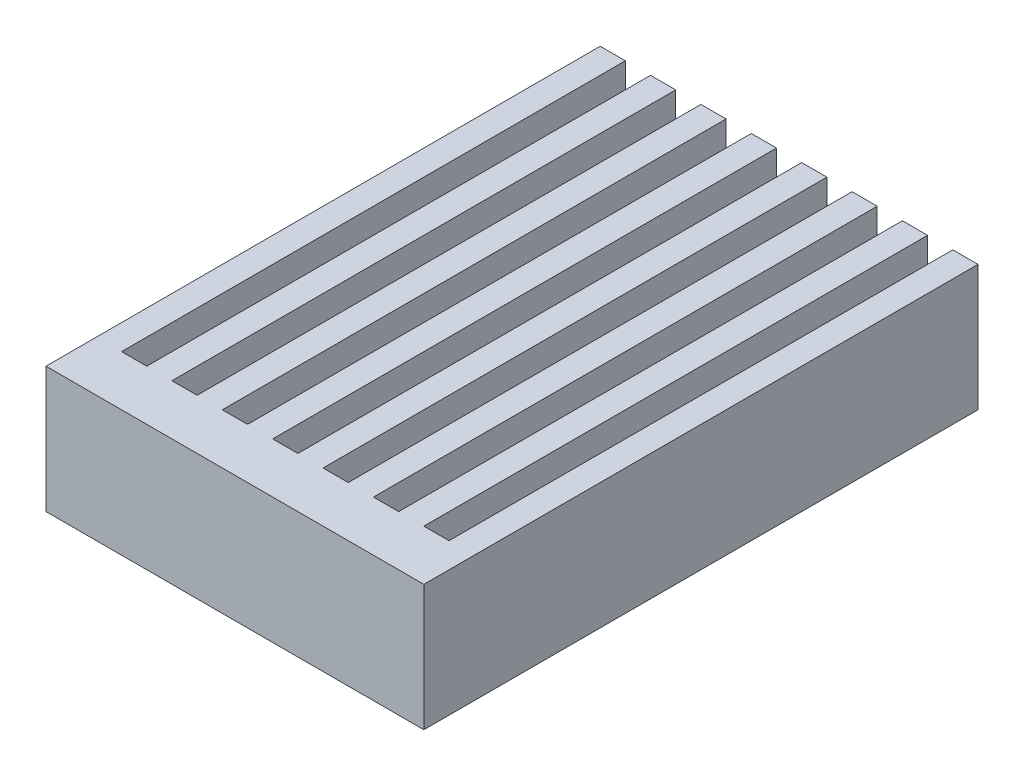
ISO-10303-21;
HEADER;
FILE_DESCRIPTION(('STEP AP214'),'2;1');
FILE_NAME('part.step','',(''),(''),'','','');
FILE_SCHEMA(('AUTOMOTIVE_DESIGN { 1 0 10303 214 1 1 1 1 }'));
ENDSEC;
DATA;
#1=APPLICATION_CONTEXT('core data for automotive mechanical design processes');
#2=APPLICATION_PROTOCOL_DEFINITION('international standard','automotive_design',2000,#1);
#3=PRODUCT_CONTEXT('',#1,'mechanical');
#4=PRODUCT('Part','Part','',(#3));
#5=PRODUCT_RELATED_PRODUCT_CATEGORY('part','',(#4));
#6=PRODUCT_DEFINITION_FORMATION('','',#4);
#7=PRODUCT_DEFINITION_CONTEXT('part definition',#1,'design');
#8=PRODUCT_DEFINITION('design','',#6,#7);
#9=PRODUCT_DEFINITION_SHAPE('','',#8);
#10=(LENGTH_UNIT() NAMED_UNIT(*) SI_UNIT(.MILLI.,.METRE.));
#11=(NAMED_UNIT(*) PLANE_ANGLE_UNIT() SI_UNIT($,.RADIAN.));
#12=(NAMED_UNIT(*) SI_UNIT($,.STERADIAN.) SOLID_ANGLE_UNIT());
#13=UNCERTAINTY_MEASURE_WITH_UNIT(LENGTH_MEASURE(1.E-05),#10,'distance_accuracy_value','');
#14=(GEOMETRIC_REPRESENTATION_CONTEXT(3) GLOBAL_UNCERTAINTY_ASSIGNED_CONTEXT((#13)) GLOBAL_UNIT_ASSIGNED_CONTEXT((#10,
#11,#12)) REPRESENTATION_CONTEXT('',''));
#15=CARTESIAN_POINT('',(0.,0.,0.));
#16=DIRECTION('',(0.,0.,1.));
#17=DIRECTION('',(1.,0.,0.));
#18=AXIS2_PLACEMENT_3D('',#15,#16,#17);
#19=CARTESIAN_POINT('',(-5.69333333333333,5.,0.313333333333333));
#20=DIRECTION('',(0.,0.,-1.));
#21=DIRECTION('',(-1.,0.,0.));
#22=AXIS2_PLACEMENT_3D('',#19,#20,#21);
#23=PLANE('',#22);
#24=DIRECTION('',(0.,-1.,0.));
#25=VECTOR('',#24,1.);
#26=CARTESIAN_POINT('',(8.30666666666667,5.,0.313333333333333));
#27=LINE('',#26,#25);
#28=CARTESIAN_POINT('',(8.30666666666667,5.,0.313333333333333));
#29=VERTEX_POINT('',#28);
#30=CARTESIAN_POINT('',(8.30666666666667,0.,0.313333333333333));
#31=VERTEX_POINT('',#30);
#32=EDGE_CURVE('E283',#29,#31,#27,.T.);
#33=ORIENTED_EDGE('',*,*,#32,.T.);
#34=DIRECTION('',(1.,0.,0.));
#35=VECTOR('',#34,1.);
#36=CARTESIAN_POINT('',(-5.69333333333333,0.,0.313333333333333));
#37=LINE('',#36,#35);
#38=CARTESIAN_POINT('',(7.30666666666667,0.,0.313333333333333));
#39=VERTEX_POINT('',#38);
#40=EDGE_CURVE('E473',#39,#31,#37,.T.);
#41=ORIENTED_EDGE('',*,*,#40,.F.);
#42=DIRECTION('',(0.,-1.,0.));
#43=VECTOR('',#42,1.);
#44=CARTESIAN_POINT('',(7.30666666666667,5.,0.313333333333332));
#45=LINE('',#44,#43);
#46=CARTESIAN_POINT('',(7.30666666666667,5.,0.313333333333332));
#47=VERTEX_POINT('',#46);
#48=EDGE_CURVE('E58',#47,#39,#45,.T.);
#49=ORIENTED_EDGE('',*,*,#48,.F.);
#50=DIRECTION('',(1.,0.,0.));
#51=VECTOR('',#50,1.);
#52=CARTESIAN_POINT('',(-5.69333333333333,5.,0.313333333333333));
#53=LINE('',#52,#51);
#54=EDGE_CURVE('E466',#47,#29,#53,.T.);
#55=ORIENTED_EDGE('',*,*,#54,.T.);
#56=EDGE_LOOP('',(#33,#41,#49,#55));
#57=FACE_BOUND('',#56,.T.);
#58=ADVANCED_FACE('F43',(#57),#23,.T.);
#59=DIRECTION('',(0.,-1.,0.));
#60=VECTOR('',#59,1.);
#61=CARTESIAN_POINT('',(6.30666666666667,5.,0.313333333333333));
#62=LINE('',#61,#60);
#63=CARTESIAN_POINT('',(6.30666666666667,5.,0.313333333333333));
#64=VERTEX_POINT('',#63);
#65=CARTESIAN_POINT('',(6.30666666666667,0.,0.313333333333333));
#66=VERTEX_POINT('',#65);
#67=EDGE_CURVE('E302',#64,#66,#62,.T.);
#68=ORIENTED_EDGE('',*,*,#67,.T.);
#69=CARTESIAN_POINT('',(5.30666666666667,0.,0.313333333333333));
#70=VERTEX_POINT('',#69);
#71=EDGE_CURVE('E536',#70,#66,#37,.T.);
#72=ORIENTED_EDGE('',*,*,#71,.F.);
#73=DIRECTION('',(0.,-1.,0.));
#74=VECTOR('',#73,1.);
#75=CARTESIAN_POINT('',(5.30666666666667,5.,0.313333333333332));
#76=LINE('',#75,#74);
#77=CARTESIAN_POINT('',(5.30666666666667,5.,0.313333333333332));
#78=VERTEX_POINT('',#77);
#79=EDGE_CURVE('E66',#78,#70,#76,.T.);
#80=ORIENTED_EDGE('',*,*,#79,.F.);
#81=EDGE_CURVE('E492',#78,#64,#53,.T.);
#82=ORIENTED_EDGE('',*,*,#81,.T.);
#83=EDGE_LOOP('',(#68,#72,#80,#82));
#84=FACE_BOUND('',#83,.T.);
#85=ADVANCED_FACE('F541',(#84),#23,.T.);
#86=DIRECTION('',(0.,-1.,0.));
#87=VECTOR('',#86,1.);
#88=CARTESIAN_POINT('',(4.30666666666667,5.,0.313333333333333));
#89=LINE('',#88,#87);
#90=CARTESIAN_POINT('',(4.30666666666667,5.,0.313333333333333));
#91=VERTEX_POINT('',#90);
#92=CARTESIAN_POINT('',(4.30666666666667,0.,0.313333333333333));
#93=VERTEX_POINT('',#92);
#94=EDGE_CURVE('E326',#91,#93,#89,.T.);
#95=ORIENTED_EDGE('',*,*,#94,.T.);
#96=CARTESIAN_POINT('',(3.30666666666667,0.,0.313333333333333));
#97=VERTEX_POINT('',#96);
#98=EDGE_CURVE('E532',#97,#93,#37,.T.);
#99=ORIENTED_EDGE('',*,*,#98,.F.);
#100=DIRECTION('',(0.,-1.,0.));
#101=VECTOR('',#100,1.);
#102=CARTESIAN_POINT('',(3.30666666666667,5.,0.313333333333332));
#103=LINE('',#102,#101);
#104=CARTESIAN_POINT('',(3.30666666666667,5.,0.313333333333332));
#105=VERTEX_POINT('',#104);
#106=EDGE_CURVE('E364',#105,#97,#103,.T.);
#107=ORIENTED_EDGE('',*,*,#106,.F.);
#108=EDGE_CURVE('E494',#105,#91,#53,.T.);
#109=ORIENTED_EDGE('',*,*,#108,.T.);
#110=EDGE_LOOP('',(#95,#99,#107,#109));
#111=FACE_BOUND('',#110,.T.);
#112=ADVANCED_FACE('F567',(#111),#23,.T.);
#113=DIRECTION('',(0.,-1.,0.));
#114=VECTOR('',#113,1.);
#115=CARTESIAN_POINT('',(2.30666666666667,5.,0.313333333333333));
#116=LINE('',#115,#114);
#117=CARTESIAN_POINT('',(2.30666666666667,5.,0.313333333333333));
#118=VERTEX_POINT('',#117);
#119=CARTESIAN_POINT('',(2.30666666666667,0.,0.313333333333333));
#120=VERTEX_POINT('',#119);
#121=EDGE_CURVE('E350',#118,#120,#116,.T.);
#122=ORIENTED_EDGE('',*,*,#121,.T.);
#123=CARTESIAN_POINT('',(1.30666666666667,0.,0.313333333333333));
#124=VERTEX_POINT('',#123);
#125=EDGE_CURVE('E529',#124,#120,#37,.T.);
#126=ORIENTED_EDGE('',*,*,#125,.F.);
#127=DIRECTION('',(0.,-1.,0.));
#128=VECTOR('',#127,1.);
#129=CARTESIAN_POINT('',(1.30666666666667,5.,0.313333333333332));
#130=LINE('',#129,#128);
#131=CARTESIAN_POINT('',(1.30666666666667,5.,0.313333333333332));
#132=VERTEX_POINT('',#131);
#133=EDGE_CURVE('E390',#132,#124,#130,.T.);
#134=ORIENTED_EDGE('',*,*,#133,.F.);
#135=EDGE_CURVE('E498',#132,#118,#53,.T.);
#136=ORIENTED_EDGE('',*,*,#135,.T.);
#137=EDGE_LOOP('',(#122,#126,#134,#136));
#138=FACE_BOUND('',#137,.T.);
#139=ADVANCED_FACE('F583',(#138),#23,.T.);
#140=DIRECTION('',(0.,-1.,0.));
#141=VECTOR('',#140,1.);
#142=CARTESIAN_POINT('',(0.306666666666669,5.,0.313333333333333));
#143=LINE('',#142,#141);
#144=CARTESIAN_POINT('',(0.306666666666669,5.,0.313333333333333));
#145=VERTEX_POINT('',#144);
#146=CARTESIAN_POINT('',(0.306666666666669,0.,0.313333333333333));
#147=VERTEX_POINT('',#146);
#148=EDGE_CURVE('E376',#145,#147,#143,.T.);
#149=ORIENTED_EDGE('',*,*,#148,.T.);
#150=CARTESIAN_POINT('',(-0.693333333333331,0.,0.313333333333333));
#151=VERTEX_POINT('',#150);
#152=EDGE_CURVE('E527',#151,#147,#37,.T.);
#153=ORIENTED_EDGE('',*,*,#152,.F.);
#154=DIRECTION('',(0.,-1.,0.));
#155=VECTOR('',#154,1.);
#156=CARTESIAN_POINT('',(-0.693333333333331,5.,0.313333333333332));
#157=LINE('',#156,#155);
#158=CARTESIAN_POINT('',(-0.693333333333331,5.,0.313333333333332));
#159=VERTEX_POINT('',#158);
#160=EDGE_CURVE('E416',#159,#151,#157,.T.);
#161=ORIENTED_EDGE('',*,*,#160,.F.);
#162=EDGE_CURVE('E503',#159,#145,#53,.T.);
#163=ORIENTED_EDGE('',*,*,#162,.T.);
#164=EDGE_LOOP('',(#149,#153,#161,#163));
#165=FACE_BOUND('',#164,.T.);
#166=ADVANCED_FACE('F577',(#165),#23,.T.);
#167=DIRECTION('',(0.,-1.,0.));
#168=VECTOR('',#167,1.);
#169=CARTESIAN_POINT('',(-1.69333333333333,5.,0.313333333333333));
#170=LINE('',#169,#168);
#171=CARTESIAN_POINT('',(-1.69333333333333,5.,0.313333333333333));
#172=VERTEX_POINT('',#171);
#173=CARTESIAN_POINT('',(-1.69333333333333,0.,0.313333333333333));
#174=VERTEX_POINT('',#173);
#175=EDGE_CURVE('E402',#172,#174,#170,.T.);
#176=ORIENTED_EDGE('',*,*,#175,.T.);
#177=CARTESIAN_POINT('',(-2.69333333333333,0.,0.313333333333333));
#178=VERTEX_POINT('',#177);
#179=EDGE_CURVE('E477',#178,#174,#37,.T.);
#180=ORIENTED_EDGE('',*,*,#179,.F.);
#181=DIRECTION('',(0.,-1.,0.));
#182=VECTOR('',#181,1.);
#183=CARTESIAN_POINT('',(-2.69333333333333,5.,0.313333333333332));
#184=LINE('',#183,#182);
#185=CARTESIAN_POINT('',(-2.69333333333333,5.,0.313333333333332));
#186=VERTEX_POINT('',#185);
#187=EDGE_CURVE('E442',#186,#178,#184,.T.);
#188=ORIENTED_EDGE('',*,*,#187,.F.);
#189=EDGE_CURVE('E469',#186,#172,#53,.T.);
#190=ORIENTED_EDGE('',*,*,#189,.T.);
#191=EDGE_LOOP('',(#176,#180,#188,#190));
#192=FACE_BOUND('',#191,.T.);
#193=ADVANCED_FACE('F515',(#192),#23,.T.);
#194=CARTESIAN_POINT('',(-5.69333333333333,5.,2.31333333333333));
#195=DIRECTION('',(-1.,0.,0.));
#196=DIRECTION('',(0.,0.,1.));
#197=AXIS2_PLACEMENT_3D('',#194,#195,#196);
#198=PLANE('',#197);
#199=DIRECTION('',(0.,0.,-1.));
#200=VECTOR('',#199,1.);
#201=CARTESIAN_POINT('',(-5.69333333333333,0.,2.31333333333333));
#202=LINE('',#201,#200);
#203=CARTESIAN_POINT('',(-5.69333333333333,0.,2.31333333333333));
#204=VERTEX_POINT('',#203);
#205=CARTESIAN_POINT('',(-5.69333333333333,0.,-19.6866666666667));
#206=VERTEX_POINT('',#205);
#207=EDGE_CURVE('E463',#204,#206,#202,.T.);
#208=ORIENTED_EDGE('',*,*,#207,.F.);
#209=DIRECTION('',(0.,-1.,0.));
#210=VECTOR('',#209,1.);
#211=CARTESIAN_POINT('',(-5.69333333333333,5.,2.31333333333333));
#212=LINE('',#211,#210);
#213=CARTESIAN_POINT('',(-5.69333333333333,5.,2.31333333333333));
#214=VERTEX_POINT('',#213);
#215=EDGE_CURVE('E11',#214,#204,#212,.T.);
#216=ORIENTED_EDGE('',*,*,#215,.F.);
#217=DIRECTION('',(0.,0.,-1.));
#218=VECTOR('',#217,1.);
#219=CARTESIAN_POINT('',(-5.69333333333333,5.,2.31333333333333));
#220=LINE('',#219,#218);
#221=CARTESIAN_POINT('',(-5.69333333333333,5.,-19.6866666666667));
#222=VERTEX_POINT('',#221);
#223=EDGE_CURVE('E464',#214,#222,#220,.T.);
#224=ORIENTED_EDGE('',*,*,#223,.T.);
#225=DIRECTION('',(0.,-1.,0.));
#226=VECTOR('',#225,1.);
#227=CARTESIAN_POINT('',(-5.69333333333333,5.,-19.6866666666667));
#228=LINE('',#227,#226);
#229=EDGE_CURVE('E451',#222,#206,#228,.T.);
#230=ORIENTED_EDGE('',*,*,#229,.T.);
#231=EDGE_LOOP('',(#208,#216,#224,#230));
#232=FACE_BOUND('',#231,.T.);
#233=ADVANCED_FACE('F45',(#232),#198,.T.);
#234=CARTESIAN_POINT('',(-5.69333333333333,5.,2.31333333333333));
#235=DIRECTION('',(0.,0.,-1.));
#236=DIRECTION('',(-1.,0.,0.));
#237=AXIS2_PLACEMENT_3D('',#234,#235,#236);
#238=PLANE('',#237);
#239=DIRECTION('',(1.,0.,0.));
#240=VECTOR('',#239,1.);
#241=CARTESIAN_POINT('',(-5.69333333333333,0.,2.31333333333333));
#242=LINE('',#241,#240);
#243=CARTESIAN_POINT('',(9.30666666666667,0.,2.31333333333333));
#244=VERTEX_POINT('',#243);
#245=EDGE_CURVE('E467',#204,#244,#242,.T.);
#246=ORIENTED_EDGE('',*,*,#245,.T.);
#247=DIRECTION('',(0.,-1.,0.));
#248=VECTOR('',#247,1.);
#249=CARTESIAN_POINT('',(9.30666666666667,5.,2.31333333333333));
#250=LINE('',#249,#248);
#251=CARTESIAN_POINT('',(9.30666666666667,5.,2.31333333333333));
#252=VERTEX_POINT('',#251);
#253=EDGE_CURVE('E47',#252,#244,#250,.T.);
#254=ORIENTED_EDGE('',*,*,#253,.F.);
#255=DIRECTION('',(1.,0.,0.));
#256=VECTOR('',#255,1.);
#257=CARTESIAN_POINT('',(-5.69333333333333,5.,2.31333333333333));
#258=LINE('',#257,#256);
#259=EDGE_CURVE('E262',#214,#252,#258,.T.);
#260=ORIENTED_EDGE('',*,*,#259,.F.);
#261=ORIENTED_EDGE('',*,*,#215,.T.);
#262=EDGE_LOOP('',(#246,#254,#260,#261));
#263=FACE_BOUND('',#262,.T.);
#264=ADVANCED_FACE('F481',(#263),#238,.F.);
#265=CARTESIAN_POINT('',(9.30666666666667,5.,2.31333333333333));
#266=DIRECTION('',(-1.,0.,0.));
#267=DIRECTION('',(0.,0.,1.));
#268=AXIS2_PLACEMENT_3D('',#265,#266,#267);
#269=PLANE('',#268);
#270=DIRECTION('',(0.,0.,-1.));
#271=VECTOR('',#270,1.);
#272=CARTESIAN_POINT('',(9.30666666666667,0.,2.31333333333333));
#273=LINE('',#272,#271);
#274=CARTESIAN_POINT('',(9.30666666666667,0.,-19.6866666666667));
#275=VERTEX_POINT('',#274);
#276=EDGE_CURVE('E272',#244,#275,#273,.T.);
#277=ORIENTED_EDGE('',*,*,#276,.T.);
#278=DIRECTION('',(0.,-1.,0.));
#279=VECTOR('',#278,1.);
#280=CARTESIAN_POINT('',(9.30666666666667,5.,-19.6866666666667));
#281=LINE('',#280,#279);
#282=CARTESIAN_POINT('',(9.30666666666667,5.,-19.6866666666667));
#283=VERTEX_POINT('',#282);
#284=EDGE_CURVE('E269',#283,#275,#281,.T.);
#285=ORIENTED_EDGE('',*,*,#284,.F.);
#286=DIRECTION('',(0.,0.,-1.));
#287=VECTOR('',#286,1.);
#288=CARTESIAN_POINT('',(9.30666666666667,5.,2.31333333333333));
#289=LINE('',#288,#287);
#290=EDGE_CURVE('E253',#252,#283,#289,.T.);
#291=ORIENTED_EDGE('',*,*,#290,.F.);
#292=ORIENTED_EDGE('',*,*,#253,.T.);
#293=EDGE_LOOP('',(#277,#285,#291,#292));
#294=FACE_BOUND('',#293,.T.);
#295=ADVANCED_FACE('F270',(#294),#269,.F.);
#296=DIRECTION('',(0.,-1.,0.));
#297=VECTOR('',#296,1.);
#298=CARTESIAN_POINT('',(-3.69333333333333,5.,0.313333333333333));
#299=LINE('',#298,#297);
#300=CARTESIAN_POINT('',(-3.69333333333333,5.,0.313333333333333));
#301=VERTEX_POINT('',#300);
#302=CARTESIAN_POINT('',(-3.69333333333333,0.,0.313333333333333));
#303=VERTEX_POINT('',#302);
#304=EDGE_CURVE('E428',#301,#303,#299,.T.);
#305=ORIENTED_EDGE('',*,*,#304,.T.);
#306=CARTESIAN_POINT('',(-4.69333333333333,0.,0.313333333333332));
#307=VERTEX_POINT('',#306);
#308=EDGE_CURVE('E474',#307,#303,#37,.T.);
#309=ORIENTED_EDGE('',*,*,#308,.F.);
#310=DIRECTION('',(0.,-1.,0.));
#311=VECTOR('',#310,1.);
#312=CARTESIAN_POINT('',(-4.69333333333333,5.,0.313333333333332));
#313=LINE('',#312,#311);
#314=CARTESIAN_POINT('',(-4.69333333333333,5.,0.313333333333333));
#315=VERTEX_POINT('',#314);
#316=EDGE_CURVE('E460',#315,#307,#313,.T.);
#317=ORIENTED_EDGE('',*,*,#316,.F.);
#318=EDGE_CURVE('E266',#315,#301,#53,.T.);
#319=ORIENTED_EDGE('',*,*,#318,.T.);
#320=EDGE_LOOP('',(#305,#309,#317,#319));
#321=FACE_BOUND('',#320,.T.);
#322=ADVANCED_FACE('F563',(#321),#23,.T.);
#323=CARTESIAN_POINT('',(0.,5.,0.));
#324=DIRECTION('',(0.,-1.,0.));
#325=DIRECTION('',(0.,0.,-1.));
#326=AXIS2_PLACEMENT_3D('',#323,#324,#325);
#327=PLANE('',#326);
#328=ORIENTED_EDGE('',*,*,#223,.F.);
#329=ORIENTED_EDGE('',*,*,#259,.T.);
#330=ORIENTED_EDGE('',*,*,#290,.T.);
#331=DIRECTION('',(1.,0.,0.));
#332=VECTOR('',#331,1.);
#333=CARTESIAN_POINT('',(8.30666666666667,5.,-19.6866666666667));
#334=LINE('',#333,#332);
#335=CARTESIAN_POINT('',(8.30666666666667,5.,-19.6866666666667));
#336=VERTEX_POINT('',#335);
#337=EDGE_CURVE('E259',#336,#283,#334,.T.);
#338=ORIENTED_EDGE('',*,*,#337,.F.);
#339=DIRECTION('',(0.,0.,-1.));
#340=VECTOR('',#339,1.);
#341=CARTESIAN_POINT('',(8.30666666666667,5.,0.313333333333333));
#342=LINE('',#341,#340);
#343=EDGE_CURVE('E280',#29,#336,#342,.T.);
#344=ORIENTED_EDGE('',*,*,#343,.F.);
#345=ORIENTED_EDGE('',*,*,#54,.F.);
#346=DIRECTION('',(0.,0.,-1.));
#347=VECTOR('',#346,1.);
#348=CARTESIAN_POINT('',(7.30666666666667,5.,0.313333333333332));
#349=LINE('',#348,#347);
#350=CARTESIAN_POINT('',(7.30666666666667,5.,-19.6866666666667));
#351=VERTEX_POINT('',#350);
#352=EDGE_CURVE('E293',#47,#351,#349,.T.);
#353=ORIENTED_EDGE('',*,*,#352,.T.);
#354=DIRECTION('',(1.,0.,0.));
#355=VECTOR('',#354,1.);
#356=CARTESIAN_POINT('',(6.30666666666667,5.,-19.6866666666667));
#357=LINE('',#356,#355);
#358=CARTESIAN_POINT('',(6.30666666666667,5.,-19.6866666666667));
#359=VERTEX_POINT('',#358);
#360=EDGE_CURVE('E295',#359,#351,#357,.T.);
#361=ORIENTED_EDGE('',*,*,#360,.F.);
#362=DIRECTION('',(0.,0.,-1.));
#363=VECTOR('',#362,1.);
#364=CARTESIAN_POINT('',(6.30666666666667,5.,0.313333333333333));
#365=LINE('',#364,#363);
#366=EDGE_CURVE('E299',#64,#359,#365,.T.);
#367=ORIENTED_EDGE('',*,*,#366,.F.);
#368=ORIENTED_EDGE('',*,*,#81,.F.);
#369=DIRECTION('',(0.,0.,-1.));
#370=VECTOR('',#369,1.);
#371=CARTESIAN_POINT('',(5.30666666666667,5.,0.313333333333332));
#372=LINE('',#371,#370);
#373=CARTESIAN_POINT('',(5.30666666666667,5.,-19.6866666666667));
#374=VERTEX_POINT('',#373);
#375=EDGE_CURVE('E317',#78,#374,#372,.T.);
#376=ORIENTED_EDGE('',*,*,#375,.T.);
#377=DIRECTION('',(1.,0.,0.));
#378=VECTOR('',#377,1.);
#379=CARTESIAN_POINT('',(4.30666666666667,5.,-19.6866666666667));
#380=LINE('',#379,#378);
#381=CARTESIAN_POINT('',(4.30666666666667,5.,-19.6866666666667));
#382=VERTEX_POINT('',#381);
#383=EDGE_CURVE('E319',#382,#374,#380,.T.);
#384=ORIENTED_EDGE('',*,*,#383,.F.);
#385=DIRECTION('',(0.,0.,-1.));
#386=VECTOR('',#385,1.);
#387=CARTESIAN_POINT('',(4.30666666666667,5.,0.313333333333333));
#388=LINE('',#387,#386);
#389=EDGE_CURVE('E323',#91,#382,#388,.T.);
#390=ORIENTED_EDGE('',*,*,#389,.F.);
#391=ORIENTED_EDGE('',*,*,#108,.F.);
#392=DIRECTION('',(0.,0.,-1.));
#393=VECTOR('',#392,1.);
#394=CARTESIAN_POINT('',(3.30666666666667,5.,0.313333333333332));
#395=LINE('',#394,#393);
#396=CARTESIAN_POINT('',(3.30666666666667,5.,-19.6866666666667));
#397=VERTEX_POINT('',#396);
#398=EDGE_CURVE('E341',#105,#397,#395,.T.);
#399=ORIENTED_EDGE('',*,*,#398,.T.);
#400=DIRECTION('',(1.,0.,0.));
#401=VECTOR('',#400,1.);
#402=CARTESIAN_POINT('',(2.30666666666667,5.,-19.6866666666667));
#403=LINE('',#402,#401);
#404=CARTESIAN_POINT('',(2.30666666666667,5.,-19.6866666666667));
#405=VERTEX_POINT('',#404);
#406=EDGE_CURVE('E343',#405,#397,#403,.T.);
#407=ORIENTED_EDGE('',*,*,#406,.F.);
#408=DIRECTION('',(0.,0.,-1.));
#409=VECTOR('',#408,1.);
#410=CARTESIAN_POINT('',(2.30666666666667,5.,0.313333333333333));
#411=LINE('',#410,#409);
#412=EDGE_CURVE('E347',#118,#405,#411,.T.);
#413=ORIENTED_EDGE('',*,*,#412,.F.);
#414=ORIENTED_EDGE('',*,*,#135,.F.);
#415=DIRECTION('',(0.,0.,-1.));
#416=VECTOR('',#415,1.);
#417=CARTESIAN_POINT('',(1.30666666666667,5.,0.313333333333332));
#418=LINE('',#417,#416);
#419=CARTESIAN_POINT('',(1.30666666666667,5.,-19.6866666666667));
#420=VERTEX_POINT('',#419);
#421=EDGE_CURVE('E367',#132,#420,#418,.T.);
#422=ORIENTED_EDGE('',*,*,#421,.T.);
#423=DIRECTION('',(1.,0.,0.));
#424=VECTOR('',#423,1.);
#425=CARTESIAN_POINT('',(0.306666666666669,5.,-19.6866666666667));
#426=LINE('',#425,#424);
#427=CARTESIAN_POINT('',(0.306666666666669,5.,-19.6866666666667));
#428=VERTEX_POINT('',#427);
#429=EDGE_CURVE('E369',#428,#420,#426,.T.);
#430=ORIENTED_EDGE('',*,*,#429,.F.);
#431=DIRECTION('',(0.,0.,-1.));
#432=VECTOR('',#431,1.);
#433=CARTESIAN_POINT('',(0.306666666666669,5.,0.313333333333333));
#434=LINE('',#433,#432);
#435=EDGE_CURVE('E373',#145,#428,#434,.T.);
#436=ORIENTED_EDGE('',*,*,#435,.F.);
#437=ORIENTED_EDGE('',*,*,#162,.F.);
#438=DIRECTION('',(0.,0.,-1.));
#439=VECTOR('',#438,1.);
#440=CARTESIAN_POINT('',(-0.693333333333331,5.,0.313333333333332));
#441=LINE('',#440,#439);
#442=CARTESIAN_POINT('',(-0.693333333333331,5.,-19.6866666666667));
#443=VERTEX_POINT('',#442);
#444=EDGE_CURVE('E393',#159,#443,#441,.T.);
#445=ORIENTED_EDGE('',*,*,#444,.T.);
#446=DIRECTION('',(1.,0.,0.));
#447=VECTOR('',#446,1.);
#448=CARTESIAN_POINT('',(-1.69333333333333,5.,-19.6866666666667));
#449=LINE('',#448,#447);
#450=CARTESIAN_POINT('',(-1.69333333333333,5.,-19.6866666666667));
#451=VERTEX_POINT('',#450);
#452=EDGE_CURVE('E395',#451,#443,#449,.T.);
#453=ORIENTED_EDGE('',*,*,#452,.F.);
#454=DIRECTION('',(0.,0.,-1.));
#455=VECTOR('',#454,1.);
#456=CARTESIAN_POINT('',(-1.69333333333333,5.,0.313333333333333));
#457=LINE('',#456,#455);
#458=EDGE_CURVE('E399',#172,#451,#457,.T.);
#459=ORIENTED_EDGE('',*,*,#458,.F.);
#460=ORIENTED_EDGE('',*,*,#189,.F.);
#461=DIRECTION('',(0.,0.,-1.));
#462=VECTOR('',#461,1.);
#463=CARTESIAN_POINT('',(-2.69333333333333,5.,0.313333333333332));
#464=LINE('',#463,#462);
#465=CARTESIAN_POINT('',(-2.69333333333333,5.,-19.6866666666667));
#466=VERTEX_POINT('',#465);
#467=EDGE_CURVE('E419',#186,#466,#464,.T.);
#468=ORIENTED_EDGE('',*,*,#467,.T.);
#469=DIRECTION('',(1.,0.,0.));
#470=VECTOR('',#469,1.);
#471=CARTESIAN_POINT('',(-3.69333333333333,5.,-19.6866666666667));
#472=LINE('',#471,#470);
#473=CARTESIAN_POINT('',(-3.69333333333333,5.,-19.6866666666667));
#474=VERTEX_POINT('',#473);
#475=EDGE_CURVE('E421',#474,#466,#472,.T.);
#476=ORIENTED_EDGE('',*,*,#475,.F.);
#477=DIRECTION('',(0.,0.,-1.));
#478=VECTOR('',#477,1.);
#479=CARTESIAN_POINT('',(-3.69333333333333,5.,0.313333333333333));
#480=LINE('',#479,#478);
#481=EDGE_CURVE('E425',#301,#474,#480,.T.);
#482=ORIENTED_EDGE('',*,*,#481,.F.);
#483=ORIENTED_EDGE('',*,*,#318,.F.);
#484=DIRECTION('',(0.,0.,-1.));
#485=VECTOR('',#484,1.);
#486=CARTESIAN_POINT('',(-4.69333333333333,5.,0.313333333333332));
#487=LINE('',#486,#485);
#488=CARTESIAN_POINT('',(-4.69333333333333,5.,-19.6866666666667));
#489=VERTEX_POINT('',#488);
#490=EDGE_CURVE('E445',#315,#489,#487,.T.);
#491=ORIENTED_EDGE('',*,*,#490,.T.);
#492=DIRECTION('',(1.,0.,0.));
#493=VECTOR('',#492,1.);
#494=CARTESIAN_POINT('',(-5.69333333333333,5.,-19.6866666666667));
#495=LINE('',#494,#493);
#496=EDGE_CURVE('E447',#222,#489,#495,.T.);
#497=ORIENTED_EDGE('',*,*,#496,.F.);
#498=EDGE_LOOP('',(#328,#329,#330,#338,#344,#345,#353,#361,#367,#368,#376,#384,#390,#391,#399,
#407,#413,#414,#422,#430,#436,#437,#445,#453,#459,#460,#468,#476,#482,#483,#491,#497));
#499=FACE_BOUND('',#498,.T.);
#500=ADVANCED_FACE('F256',(#499),#327,.F.);
#501=CARTESIAN_POINT('',(0.,0.,0.));
#502=DIRECTION('',(0.,-1.,0.));
#503=DIRECTION('',(0.,0.,-1.));
#504=AXIS2_PLACEMENT_3D('',#501,#502,#503);
#505=PLANE('',#504);
#506=ORIENTED_EDGE('',*,*,#207,.T.);
#507=DIRECTION('',(1.,0.,0.));
#508=VECTOR('',#507,1.);
#509=CARTESIAN_POINT('',(-5.69333333333333,0.,-19.6866666666667));
#510=LINE('',#509,#508);
#511=CARTESIAN_POINT('',(-4.69333333333333,0.,-19.6866666666667));
#512=VERTEX_POINT('',#511);
#513=EDGE_CURVE('E448',#206,#512,#510,.T.);
#514=ORIENTED_EDGE('',*,*,#513,.T.);
#515=DIRECTION('',(0.,0.,-1.));
#516=VECTOR('',#515,1.);
#517=CARTESIAN_POINT('',(-4.69333333333333,0.,0.313333333333332));
#518=LINE('',#517,#516);
#519=EDGE_CURVE('E444',#307,#512,#518,.T.);
#520=ORIENTED_EDGE('',*,*,#519,.F.);
#521=ORIENTED_EDGE('',*,*,#308,.T.);
#522=DIRECTION('',(0.,0.,-1.));
#523=VECTOR('',#522,1.);
#524=CARTESIAN_POINT('',(-3.69333333333333,0.,0.313333333333333));
#525=LINE('',#524,#523);
#526=CARTESIAN_POINT('',(-3.69333333333333,0.,-19.6866666666667));
#527=VERTEX_POINT('',#526);
#528=EDGE_CURVE('E422',#303,#527,#525,.T.);
#529=ORIENTED_EDGE('',*,*,#528,.T.);
#530=DIRECTION('',(1.,0.,0.));
#531=VECTOR('',#530,1.);
#532=CARTESIAN_POINT('',(-3.69333333333333,0.,-19.6866666666667));
#533=LINE('',#532,#531);
#534=CARTESIAN_POINT('',(-2.69333333333333,0.,-19.6866666666667));
#535=VERTEX_POINT('',#534);
#536=EDGE_CURVE('E431',#527,#535,#533,.T.);
#537=ORIENTED_EDGE('',*,*,#536,.T.);
#538=DIRECTION('',(0.,0.,-1.));
#539=VECTOR('',#538,1.);
#540=CARTESIAN_POINT('',(-2.69333333333333,0.,0.313333333333332));
#541=LINE('',#540,#539);
#542=EDGE_CURVE('E418',#178,#535,#541,.T.);
#543=ORIENTED_EDGE('',*,*,#542,.F.);
#544=ORIENTED_EDGE('',*,*,#179,.T.);
#545=DIRECTION('',(0.,0.,-1.));
#546=VECTOR('',#545,1.);
#547=CARTESIAN_POINT('',(-1.69333333333333,0.,0.313333333333333));
#548=LINE('',#547,#546);
#549=CARTESIAN_POINT('',(-1.69333333333333,0.,-19.6866666666667));
#550=VERTEX_POINT('',#549);
#551=EDGE_CURVE('E396',#174,#550,#548,.T.);
#552=ORIENTED_EDGE('',*,*,#551,.T.);
#553=DIRECTION('',(1.,0.,0.));
#554=VECTOR('',#553,1.);
#555=CARTESIAN_POINT('',(-1.69333333333333,0.,-19.6866666666667));
#556=LINE('',#555,#554);
#557=CARTESIAN_POINT('',(-0.693333333333331,0.,-19.6866666666667));
#558=VERTEX_POINT('',#557);
#559=EDGE_CURVE('E405',#550,#558,#556,.T.);
#560=ORIENTED_EDGE('',*,*,#559,.T.);
#561=DIRECTION('',(0.,0.,-1.));
#562=VECTOR('',#561,1.);
#563=CARTESIAN_POINT('',(-0.693333333333331,0.,0.313333333333332));
#564=LINE('',#563,#562);
#565=EDGE_CURVE('E392',#151,#558,#564,.T.);
#566=ORIENTED_EDGE('',*,*,#565,.F.);
#567=ORIENTED_EDGE('',*,*,#152,.T.);
#568=DIRECTION('',(0.,0.,-1.));
#569=VECTOR('',#568,1.);
#570=CARTESIAN_POINT('',(0.306666666666669,0.,0.313333333333333));
#571=LINE('',#570,#569);
#572=CARTESIAN_POINT('',(0.306666666666669,0.,-19.6866666666667));
#573=VERTEX_POINT('',#572);
#574=EDGE_CURVE('E370',#147,#573,#571,.T.);
#575=ORIENTED_EDGE('',*,*,#574,.T.);
#576=DIRECTION('',(1.,0.,0.));
#577=VECTOR('',#576,1.);
#578=CARTESIAN_POINT('',(0.306666666666669,0.,-19.6866666666667));
#579=LINE('',#578,#577);
#580=CARTESIAN_POINT('',(1.30666666666667,0.,-19.6866666666667));
#581=VERTEX_POINT('',#580);
#582=EDGE_CURVE('E379',#573,#581,#579,.T.);
#583=ORIENTED_EDGE('',*,*,#582,.T.);
#584=DIRECTION('',(0.,0.,-1.));
#585=VECTOR('',#584,1.);
#586=CARTESIAN_POINT('',(1.30666666666667,0.,0.313333333333332));
#587=LINE('',#586,#585);
#588=EDGE_CURVE('E366',#124,#581,#587,.T.);
#589=ORIENTED_EDGE('',*,*,#588,.F.);
#590=ORIENTED_EDGE('',*,*,#125,.T.);
#591=DIRECTION('',(0.,0.,-1.));
#592=VECTOR('',#591,1.);
#593=CARTESIAN_POINT('',(2.30666666666667,0.,0.313333333333333));
#594=LINE('',#593,#592);
#595=CARTESIAN_POINT('',(2.30666666666667,0.,-19.6866666666667));
#596=VERTEX_POINT('',#595);
#597=EDGE_CURVE('E344',#120,#596,#594,.T.);
#598=ORIENTED_EDGE('',*,*,#597,.T.);
#599=DIRECTION('',(1.,0.,0.));
#600=VECTOR('',#599,1.);
#601=CARTESIAN_POINT('',(2.30666666666667,0.,-19.6866666666667));
#602=LINE('',#601,#600);
#603=CARTESIAN_POINT('',(3.30666666666667,0.,-19.6866666666667));
#604=VERTEX_POINT('',#603);
#605=EDGE_CURVE('E353',#596,#604,#602,.T.);
#606=ORIENTED_EDGE('',*,*,#605,.T.);
#607=DIRECTION('',(0.,0.,-1.));
#608=VECTOR('',#607,1.);
#609=CARTESIAN_POINT('',(3.30666666666667,0.,0.313333333333332));
#610=LINE('',#609,#608);
#611=EDGE_CURVE('E340',#97,#604,#610,.T.);
#612=ORIENTED_EDGE('',*,*,#611,.F.);
#613=ORIENTED_EDGE('',*,*,#98,.T.);
#614=DIRECTION('',(0.,0.,-1.));
#615=VECTOR('',#614,1.);
#616=CARTESIAN_POINT('',(4.30666666666667,0.,0.313333333333333));
#617=LINE('',#616,#615);
#618=CARTESIAN_POINT('',(4.30666666666667,0.,-19.6866666666667));
#619=VERTEX_POINT('',#618);
#620=EDGE_CURVE('E320',#93,#619,#617,.T.);
#621=ORIENTED_EDGE('',*,*,#620,.T.);
#622=DIRECTION('',(1.,0.,0.));
#623=VECTOR('',#622,1.);
#624=CARTESIAN_POINT('',(4.30666666666667,0.,-19.6866666666667));
#625=LINE('',#624,#623);
#626=CARTESIAN_POINT('',(5.30666666666667,0.,-19.6866666666667));
#627=VERTEX_POINT('',#626);
#628=EDGE_CURVE('E328',#619,#627,#625,.T.);
#629=ORIENTED_EDGE('',*,*,#628,.T.);
#630=DIRECTION('',(0.,0.,-1.));
#631=VECTOR('',#630,1.);
#632=CARTESIAN_POINT('',(5.30666666666667,0.,0.313333333333332));
#633=LINE('',#632,#631);
#634=EDGE_CURVE('E316',#70,#627,#633,.T.);
#635=ORIENTED_EDGE('',*,*,#634,.F.);
#636=ORIENTED_EDGE('',*,*,#71,.T.);
#637=DIRECTION('',(0.,0.,-1.));
#638=VECTOR('',#637,1.);
#639=CARTESIAN_POINT('',(6.30666666666667,0.,0.313333333333333));
#640=LINE('',#639,#638);
#641=CARTESIAN_POINT('',(6.30666666666667,0.,-19.6866666666667));
#642=VERTEX_POINT('',#641);
#643=EDGE_CURVE('E296',#66,#642,#640,.T.);
#644=ORIENTED_EDGE('',*,*,#643,.T.);
#645=DIRECTION('',(1.,0.,0.));
#646=VECTOR('',#645,1.);
#647=CARTESIAN_POINT('',(6.30666666666667,0.,-19.6866666666667));
#648=LINE('',#647,#646);
#649=CARTESIAN_POINT('',(7.30666666666667,0.,-19.6866666666667));
#650=VERTEX_POINT('',#649);
#651=EDGE_CURVE('E304',#642,#650,#648,.T.);
#652=ORIENTED_EDGE('',*,*,#651,.T.);
#653=DIRECTION('',(0.,0.,-1.));
#654=VECTOR('',#653,1.);
#655=CARTESIAN_POINT('',(7.30666666666667,0.,0.313333333333332));
#656=LINE('',#655,#654);
#657=EDGE_CURVE('E276',#39,#650,#656,.T.);
#658=ORIENTED_EDGE('',*,*,#657,.F.);
#659=ORIENTED_EDGE('',*,*,#40,.T.);
#660=DIRECTION('',(0.,0.,-1.));
#661=VECTOR('',#660,1.);
#662=CARTESIAN_POINT('',(8.30666666666667,0.,0.313333333333333));
#663=LINE('',#662,#661);
#664=CARTESIAN_POINT('',(8.30666666666667,0.,-19.6866666666667));
#665=VERTEX_POINT('',#664);
#666=EDGE_CURVE('E281',#31,#665,#663,.T.);
#667=ORIENTED_EDGE('',*,*,#666,.T.);
#668=DIRECTION('',(1.,0.,0.));
#669=VECTOR('',#668,1.);
#670=CARTESIAN_POINT('',(8.30666666666667,0.,-19.6866666666667));
#671=LINE('',#670,#669);
#672=EDGE_CURVE('E286',#665,#275,#671,.T.);
#673=ORIENTED_EDGE('',*,*,#672,.T.);
#674=ORIENTED_EDGE('',*,*,#276,.F.);
#675=ORIENTED_EDGE('',*,*,#245,.F.);
#676=EDGE_LOOP('',(#506,#514,#520,#521,#529,#537,#543,#544,#552,#560,#566,#567,#575,#583,#589,
#590,#598,#606,#612,#613,#621,#629,#635,#636,#644,#652,#658,#659,#667,#673,#674,#675));
#677=FACE_BOUND('',#676,.T.);
#678=ADVANCED_FACE('F484',(#677),#505,.T.);
#679=CARTESIAN_POINT('',(-4.69333333333333,5.,0.313333333333332));
#680=DIRECTION('',(-1.,0.,0.));
#681=DIRECTION('',(0.,0.,1.));
#682=AXIS2_PLACEMENT_3D('',#679,#680,#681);
#683=PLANE('',#682);
#684=ORIENTED_EDGE('',*,*,#519,.T.);
#685=DIRECTION('',(0.,-1.,0.));
#686=VECTOR('',#685,1.);
#687=CARTESIAN_POINT('',(-4.69333333333333,5.,-19.6866666666667));
#688=LINE('',#687,#686);
#689=EDGE_CURVE('E458',#489,#512,#688,.T.);
#690=ORIENTED_EDGE('',*,*,#689,.F.);
#691=ORIENTED_EDGE('',*,*,#490,.F.);
#692=ORIENTED_EDGE('',*,*,#316,.T.);
#693=EDGE_LOOP('',(#684,#690,#691,#692));
#694=FACE_BOUND('',#693,.T.);
#695=ADVANCED_FACE('F657',(#694),#683,.F.);
#696=CARTESIAN_POINT('',(-5.69333333333333,5.,-19.6866666666667));
#697=DIRECTION('',(0.,0.,-1.));
#698=DIRECTION('',(-1.,0.,0.));
#699=AXIS2_PLACEMENT_3D('',#696,#697,#698);
#700=PLANE('',#699);
#701=ORIENTED_EDGE('',*,*,#513,.F.);
#702=ORIENTED_EDGE('',*,*,#229,.F.);
#703=ORIENTED_EDGE('',*,*,#496,.T.);
#704=ORIENTED_EDGE('',*,*,#689,.T.);
#705=EDGE_LOOP('',(#701,#702,#703,#704));
#706=FACE_BOUND('',#705,.T.);
#707=ADVANCED_FACE('F653',(#706),#700,.T.);
#708=CARTESIAN_POINT('',(-2.69333333333333,5.,0.313333333333332));
#709=DIRECTION('',(-1.,0.,0.));
#710=DIRECTION('',(0.,0.,1.));
#711=AXIS2_PLACEMENT_3D('',#708,#709,#710);
#712=PLANE('',#711);
#713=ORIENTED_EDGE('',*,*,#542,.T.);
#714=DIRECTION('',(0.,-1.,0.));
#715=VECTOR('',#714,1.);
#716=CARTESIAN_POINT('',(-2.69333333333333,5.,-19.6866666666667));
#717=LINE('',#716,#715);
#718=EDGE_CURVE('E440',#466,#535,#717,.T.);
#719=ORIENTED_EDGE('',*,*,#718,.F.);
#720=ORIENTED_EDGE('',*,*,#467,.F.);
#721=ORIENTED_EDGE('',*,*,#187,.T.);
#722=EDGE_LOOP('',(#713,#719,#720,#721));
#723=FACE_BOUND('',#722,.T.);
#724=ADVANCED_FACE('F649',(#723),#712,.F.);
#725=CARTESIAN_POINT('',(-3.69333333333333,5.,-19.6866666666667));
#726=DIRECTION('',(0.,0.,-1.));
#727=DIRECTION('',(-1.,0.,0.));
#728=AXIS2_PLACEMENT_3D('',#725,#726,#727);
#729=PLANE('',#728);
#730=ORIENTED_EDGE('',*,*,#536,.F.);
#731=DIRECTION('',(0.,-1.,0.));
#732=VECTOR('',#731,1.);
#733=CARTESIAN_POINT('',(-3.69333333333333,5.,-19.6866666666667));
#734=LINE('',#733,#732);
#735=EDGE_CURVE('E438',#474,#527,#734,.T.);
#736=ORIENTED_EDGE('',*,*,#735,.F.);
#737=ORIENTED_EDGE('',*,*,#475,.T.);
#738=ORIENTED_EDGE('',*,*,#718,.T.);
#739=EDGE_LOOP('',(#730,#736,#737,#738));
#740=FACE_BOUND('',#739,.T.);
#741=ADVANCED_FACE('F645',(#740),#729,.T.);
#742=CARTESIAN_POINT('',(-3.69333333333333,5.,0.313333333333333));
#743=DIRECTION('',(-1.,0.,0.));
#744=DIRECTION('',(0.,0.,1.));
#745=AXIS2_PLACEMENT_3D('',#742,#743,#744);
#746=PLANE('',#745);
#747=ORIENTED_EDGE('',*,*,#528,.F.);
#748=ORIENTED_EDGE('',*,*,#304,.F.);
#749=ORIENTED_EDGE('',*,*,#481,.T.);
#750=ORIENTED_EDGE('',*,*,#735,.T.);
#751=EDGE_LOOP('',(#747,#748,#749,#750));
#752=FACE_BOUND('',#751,.T.);
#753=ADVANCED_FACE('F641',(#752),#746,.T.);
#754=CARTESIAN_POINT('',(-0.693333333333331,5.,0.313333333333332));
#755=DIRECTION('',(-1.,0.,0.));
#756=DIRECTION('',(0.,0.,1.));
#757=AXIS2_PLACEMENT_3D('',#754,#755,#756);
#758=PLANE('',#757);
#759=ORIENTED_EDGE('',*,*,#565,.T.);
#760=DIRECTION('',(0.,-1.,0.));
#761=VECTOR('',#760,1.);
#762=CARTESIAN_POINT('',(-0.693333333333331,5.,-19.6866666666667));
#763=LINE('',#762,#761);
#764=EDGE_CURVE('E414',#443,#558,#763,.T.);
#765=ORIENTED_EDGE('',*,*,#764,.F.);
#766=ORIENTED_EDGE('',*,*,#444,.F.);
#767=ORIENTED_EDGE('',*,*,#160,.T.);
#768=EDGE_LOOP('',(#759,#765,#766,#767));
#769=FACE_BOUND('',#768,.T.);
#770=ADVANCED_FACE('F637',(#769),#758,.F.);
#771=CARTESIAN_POINT('',(-1.69333333333333,5.,-19.6866666666667));
#772=DIRECTION('',(0.,0.,-1.));
#773=DIRECTION('',(-1.,0.,0.));
#774=AXIS2_PLACEMENT_3D('',#771,#772,#773);
#775=PLANE('',#774);
#776=ORIENTED_EDGE('',*,*,#559,.F.);
#777=DIRECTION('',(0.,-1.,0.));
#778=VECTOR('',#777,1.);
#779=CARTESIAN_POINT('',(-1.69333333333333,5.,-19.6866666666667));
#780=LINE('',#779,#778);
#781=EDGE_CURVE('E412',#451,#550,#780,.T.);
#782=ORIENTED_EDGE('',*,*,#781,.F.);
#783=ORIENTED_EDGE('',*,*,#452,.T.);
#784=ORIENTED_EDGE('',*,*,#764,.T.);
#785=EDGE_LOOP('',(#776,#782,#783,#784));
#786=FACE_BOUND('',#785,.T.);
#787=ADVANCED_FACE('F634',(#786),#775,.T.);
#788=CARTESIAN_POINT('',(-1.69333333333333,5.,0.313333333333333));
#789=DIRECTION('',(-1.,0.,0.));
#790=DIRECTION('',(0.,0.,1.));
#791=AXIS2_PLACEMENT_3D('',#788,#789,#790);
#792=PLANE('',#791);
#793=ORIENTED_EDGE('',*,*,#551,.F.);
#794=ORIENTED_EDGE('',*,*,#175,.F.);
#795=ORIENTED_EDGE('',*,*,#458,.T.);
#796=ORIENTED_EDGE('',*,*,#781,.T.);
#797=EDGE_LOOP('',(#793,#794,#795,#796));
#798=FACE_BOUND('',#797,.T.);
#799=ADVANCED_FACE('F523',(#798),#792,.T.);
#800=CARTESIAN_POINT('',(1.30666666666667,5.,0.313333333333332));
#801=DIRECTION('',(-1.,0.,0.));
#802=DIRECTION('',(0.,0.,1.));
#803=AXIS2_PLACEMENT_3D('',#800,#801,#802);
#804=PLANE('',#803);
#805=ORIENTED_EDGE('',*,*,#588,.T.);
#806=DIRECTION('',(0.,-1.,0.));
#807=VECTOR('',#806,1.);
#808=CARTESIAN_POINT('',(1.30666666666667,5.,-19.6866666666667));
#809=LINE('',#808,#807);
#810=EDGE_CURVE('E388',#420,#581,#809,.T.);
#811=ORIENTED_EDGE('',*,*,#810,.F.);
#812=ORIENTED_EDGE('',*,*,#421,.F.);
#813=ORIENTED_EDGE('',*,*,#133,.T.);
#814=EDGE_LOOP('',(#805,#811,#812,#813));
#815=FACE_BOUND('',#814,.T.);
#816=ADVANCED_FACE('F629',(#815),#804,.F.);
#817=CARTESIAN_POINT('',(0.306666666666669,5.,-19.6866666666667));
#818=DIRECTION('',(0.,0.,-1.));
#819=DIRECTION('',(-1.,0.,0.));
#820=AXIS2_PLACEMENT_3D('',#817,#818,#819);
#821=PLANE('',#820);
#822=ORIENTED_EDGE('',*,*,#582,.F.);
#823=DIRECTION('',(0.,-1.,0.));
#824=VECTOR('',#823,1.);
#825=CARTESIAN_POINT('',(0.306666666666669,5.,-19.6866666666667));
#826=LINE('',#825,#824);
#827=EDGE_CURVE('E386',#428,#573,#826,.T.);
#828=ORIENTED_EDGE('',*,*,#827,.F.);
#829=ORIENTED_EDGE('',*,*,#429,.T.);
#830=ORIENTED_EDGE('',*,*,#810,.T.);
#831=EDGE_LOOP('',(#822,#828,#829,#830));
#832=FACE_BOUND('',#831,.T.);
#833=ADVANCED_FACE('F594',(#832),#821,.T.);
#834=CARTESIAN_POINT('',(0.306666666666669,5.,0.313333333333333));
#835=DIRECTION('',(-1.,0.,0.));
#836=DIRECTION('',(0.,0.,1.));
#837=AXIS2_PLACEMENT_3D('',#834,#835,#836);
#838=PLANE('',#837);
#839=ORIENTED_EDGE('',*,*,#574,.F.);
#840=ORIENTED_EDGE('',*,*,#148,.F.);
#841=ORIENTED_EDGE('',*,*,#435,.T.);
#842=ORIENTED_EDGE('',*,*,#827,.T.);
#843=EDGE_LOOP('',(#839,#840,#841,#842));
#844=FACE_BOUND('',#843,.T.);
#845=ADVANCED_FACE('F589',(#844),#838,.T.);
#846=CARTESIAN_POINT('',(3.30666666666667,5.,0.313333333333332));
#847=DIRECTION('',(-1.,0.,0.));
#848=DIRECTION('',(0.,0.,1.));
#849=AXIS2_PLACEMENT_3D('',#846,#847,#848);
#850=PLANE('',#849);
#851=ORIENTED_EDGE('',*,*,#611,.T.);
#852=DIRECTION('',(0.,-1.,0.));
#853=VECTOR('',#852,1.);
#854=CARTESIAN_POINT('',(3.30666666666667,5.,-19.6866666666667));
#855=LINE('',#854,#853);
#856=EDGE_CURVE('E362',#397,#604,#855,.T.);
#857=ORIENTED_EDGE('',*,*,#856,.F.);
#858=ORIENTED_EDGE('',*,*,#398,.F.);
#859=ORIENTED_EDGE('',*,*,#106,.T.);
#860=EDGE_LOOP('',(#851,#857,#858,#859));
#861=FACE_BOUND('',#860,.T.);
#862=ADVANCED_FACE('F622',(#861),#850,.F.);
#863=CARTESIAN_POINT('',(2.30666666666667,5.,-19.6866666666667));
#864=DIRECTION('',(0.,0.,-1.));
#865=DIRECTION('',(-1.,0.,0.));
#866=AXIS2_PLACEMENT_3D('',#863,#864,#865);
#867=PLANE('',#866);
#868=ORIENTED_EDGE('',*,*,#605,.F.);
#869=DIRECTION('',(0.,-1.,0.));
#870=VECTOR('',#869,1.);
#871=CARTESIAN_POINT('',(2.30666666666667,5.,-19.6866666666667));
#872=LINE('',#871,#870);
#873=EDGE_CURVE('E360',#405,#596,#872,.T.);
#874=ORIENTED_EDGE('',*,*,#873,.F.);
#875=ORIENTED_EDGE('',*,*,#406,.T.);
#876=ORIENTED_EDGE('',*,*,#856,.T.);
#877=EDGE_LOOP('',(#868,#874,#875,#876));
#878=FACE_BOUND('',#877,.T.);
#879=ADVANCED_FACE('F603',(#878),#867,.T.);
#880=CARTESIAN_POINT('',(2.30666666666667,5.,0.313333333333333));
#881=DIRECTION('',(-1.,0.,0.));
#882=DIRECTION('',(0.,0.,1.));
#883=AXIS2_PLACEMENT_3D('',#880,#881,#882);
#884=PLANE('',#883);
#885=ORIENTED_EDGE('',*,*,#597,.F.);
#886=ORIENTED_EDGE('',*,*,#121,.F.);
#887=ORIENTED_EDGE('',*,*,#412,.T.);
#888=ORIENTED_EDGE('',*,*,#873,.T.);
#889=EDGE_LOOP('',(#885,#886,#887,#888));
#890=FACE_BOUND('',#889,.T.);
#891=ADVANCED_FACE('F598',(#890),#884,.T.);
#892=CARTESIAN_POINT('',(5.30666666666667,5.,0.313333333333332));
#893=DIRECTION('',(-1.,0.,0.));
#894=DIRECTION('',(0.,0.,1.));
#895=AXIS2_PLACEMENT_3D('',#892,#893,#894);
#896=PLANE('',#895);
#897=ORIENTED_EDGE('',*,*,#634,.T.);
#898=DIRECTION('',(0.,-1.,0.));
#899=VECTOR('',#898,1.);
#900=CARTESIAN_POINT('',(5.30666666666667,5.,-19.6866666666667));
#901=LINE('',#900,#899);
#902=EDGE_CURVE('E337',#374,#627,#901,.T.);
#903=ORIENTED_EDGE('',*,*,#902,.F.);
#904=ORIENTED_EDGE('',*,*,#375,.F.);
#905=ORIENTED_EDGE('',*,*,#79,.T.);
#906=EDGE_LOOP('',(#897,#903,#904,#905));
#907=FACE_BOUND('',#906,.T.);
#908=ADVANCED_FACE('F610',(#907),#896,.F.);
#909=CARTESIAN_POINT('',(4.30666666666667,5.,-19.6866666666667));
#910=DIRECTION('',(0.,0.,-1.));
#911=DIRECTION('',(-1.,0.,0.));
#912=AXIS2_PLACEMENT_3D('',#909,#910,#911);
#913=PLANE('',#912);
#914=ORIENTED_EDGE('',*,*,#628,.F.);
#915=DIRECTION('',(0.,-1.,0.));
#916=VECTOR('',#915,1.);
#917=CARTESIAN_POINT('',(4.30666666666667,5.,-19.6866666666667));
#918=LINE('',#917,#916);
#919=EDGE_CURVE('E335',#382,#619,#918,.T.);
#920=ORIENTED_EDGE('',*,*,#919,.F.);
#921=ORIENTED_EDGE('',*,*,#383,.T.);
#922=ORIENTED_EDGE('',*,*,#902,.T.);
#923=EDGE_LOOP('',(#914,#920,#921,#922));
#924=FACE_BOUND('',#923,.T.);
#925=ADVANCED_FACE('F559',(#924),#913,.T.);
#926=CARTESIAN_POINT('',(4.30666666666667,5.,0.313333333333333));
#927=DIRECTION('',(-1.,0.,0.));
#928=DIRECTION('',(0.,0.,1.));
#929=AXIS2_PLACEMENT_3D('',#926,#927,#928);
#930=PLANE('',#929);
#931=ORIENTED_EDGE('',*,*,#620,.F.);
#932=ORIENTED_EDGE('',*,*,#94,.F.);
#933=ORIENTED_EDGE('',*,*,#389,.T.);
#934=ORIENTED_EDGE('',*,*,#919,.T.);
#935=EDGE_LOOP('',(#931,#932,#933,#934));
#936=FACE_BOUND('',#935,.T.);
#937=ADVANCED_FACE('F552',(#936),#930,.T.);
#938=CARTESIAN_POINT('',(7.30666666666667,5.,0.313333333333332));
#939=DIRECTION('',(-1.,0.,0.));
#940=DIRECTION('',(0.,0.,1.));
#941=AXIS2_PLACEMENT_3D('',#938,#939,#940);
#942=PLANE('',#941);
#943=ORIENTED_EDGE('',*,*,#657,.T.);
#944=DIRECTION('',(0.,-1.,0.));
#945=VECTOR('',#944,1.);
#946=CARTESIAN_POINT('',(7.30666666666667,5.,-19.6866666666667));
#947=LINE('',#946,#945);
#948=EDGE_CURVE('E313',#351,#650,#947,.T.);
#949=ORIENTED_EDGE('',*,*,#948,.F.);
#950=ORIENTED_EDGE('',*,*,#352,.F.);
#951=ORIENTED_EDGE('',*,*,#48,.T.);
#952=EDGE_LOOP('',(#943,#949,#950,#951));
#953=FACE_BOUND('',#952,.T.);
#954=ADVANCED_FACE('F550',(#953),#942,.F.);
#955=CARTESIAN_POINT('',(6.30666666666667,5.,-19.6866666666667));
#956=DIRECTION('',(0.,0.,-1.));
#957=DIRECTION('',(-1.,0.,0.));
#958=AXIS2_PLACEMENT_3D('',#955,#956,#957);
#959=PLANE('',#958);
#960=ORIENTED_EDGE('',*,*,#651,.F.);
#961=DIRECTION('',(0.,-1.,0.));
#962=VECTOR('',#961,1.);
#963=CARTESIAN_POINT('',(6.30666666666667,5.,-19.6866666666667));
#964=LINE('',#963,#962);
#965=EDGE_CURVE('E311',#359,#642,#964,.T.);
#966=ORIENTED_EDGE('',*,*,#965,.F.);
#967=ORIENTED_EDGE('',*,*,#360,.T.);
#968=ORIENTED_EDGE('',*,*,#948,.T.);
#969=EDGE_LOOP('',(#960,#966,#967,#968));
#970=FACE_BOUND('',#969,.T.);
#971=ADVANCED_FACE('F549',(#970),#959,.T.);
#972=CARTESIAN_POINT('',(6.30666666666667,5.,0.313333333333333));
#973=DIRECTION('',(-1.,0.,0.));
#974=DIRECTION('',(0.,0.,1.));
#975=AXIS2_PLACEMENT_3D('',#972,#973,#974);
#976=PLANE('',#975);
#977=ORIENTED_EDGE('',*,*,#643,.F.);
#978=ORIENTED_EDGE('',*,*,#67,.F.);
#979=ORIENTED_EDGE('',*,*,#366,.T.);
#980=ORIENTED_EDGE('',*,*,#965,.T.);
#981=EDGE_LOOP('',(#977,#978,#979,#980));
#982=FACE_BOUND('',#981,.T.);
#983=ADVANCED_FACE('F544',(#982),#976,.T.);
#984=CARTESIAN_POINT('',(8.30666666666667,5.,-19.6866666666667));
#985=DIRECTION('',(0.,0.,-1.));
#986=DIRECTION('',(-1.,0.,0.));
#987=AXIS2_PLACEMENT_3D('',#984,#985,#986);
#988=PLANE('',#987);
#989=ORIENTED_EDGE('',*,*,#672,.F.);
#990=DIRECTION('',(0.,-1.,0.));
#991=VECTOR('',#990,1.);
#992=CARTESIAN_POINT('',(8.30666666666667,5.,-19.6866666666667));
#993=LINE('',#992,#991);
#994=EDGE_CURVE('E277',#336,#665,#993,.T.);
#995=ORIENTED_EDGE('',*,*,#994,.F.);
#996=ORIENTED_EDGE('',*,*,#337,.T.);
#997=ORIENTED_EDGE('',*,*,#284,.T.);
#998=EDGE_LOOP('',(#989,#995,#996,#997));
#999=FACE_BOUND('',#998,.T.);
#1000=ADVANCED_FACE('F279',(#999),#988,.T.);
#1001=CARTESIAN_POINT('',(8.30666666666667,5.,0.313333333333333));
#1002=DIRECTION('',(-1.,0.,0.));
#1003=DIRECTION('',(0.,0.,1.));
#1004=AXIS2_PLACEMENT_3D('',#1001,#1002,#1003);
#1005=PLANE('',#1004);
#1006=ORIENTED_EDGE('',*,*,#666,.F.);
#1007=ORIENTED_EDGE('',*,*,#32,.F.);
#1008=ORIENTED_EDGE('',*,*,#343,.T.);
#1009=ORIENTED_EDGE('',*,*,#994,.T.);
#1010=EDGE_LOOP('',(#1006,#1007,#1008,#1009));
#1011=FACE_BOUND('',#1010,.T.);
#1012=ADVANCED_FACE('F488',(#1011),#1005,.T.);
#1013=CLOSED_SHELL('',(#58,#85,#112,#139,#166,#193,#233,#264,#295,#322,#500,#678,#695,#707,#724,
#741,#753,#770,#787,#799,#816,#833,#845,#862,#879,#891,#908,#925,#937,#954,#971,#983,#1000,#1012));
#1014=MANIFOLD_SOLID_BREP('B2',#1013);
#1015=ADVANCED_BREP_SHAPE_REPRESENTATION('',(#18,#1014),#14);
#1016=SHAPE_DEFINITION_REPRESENTATION(#9,#1015);
ENDSEC;
END-ISO-10303-21;
